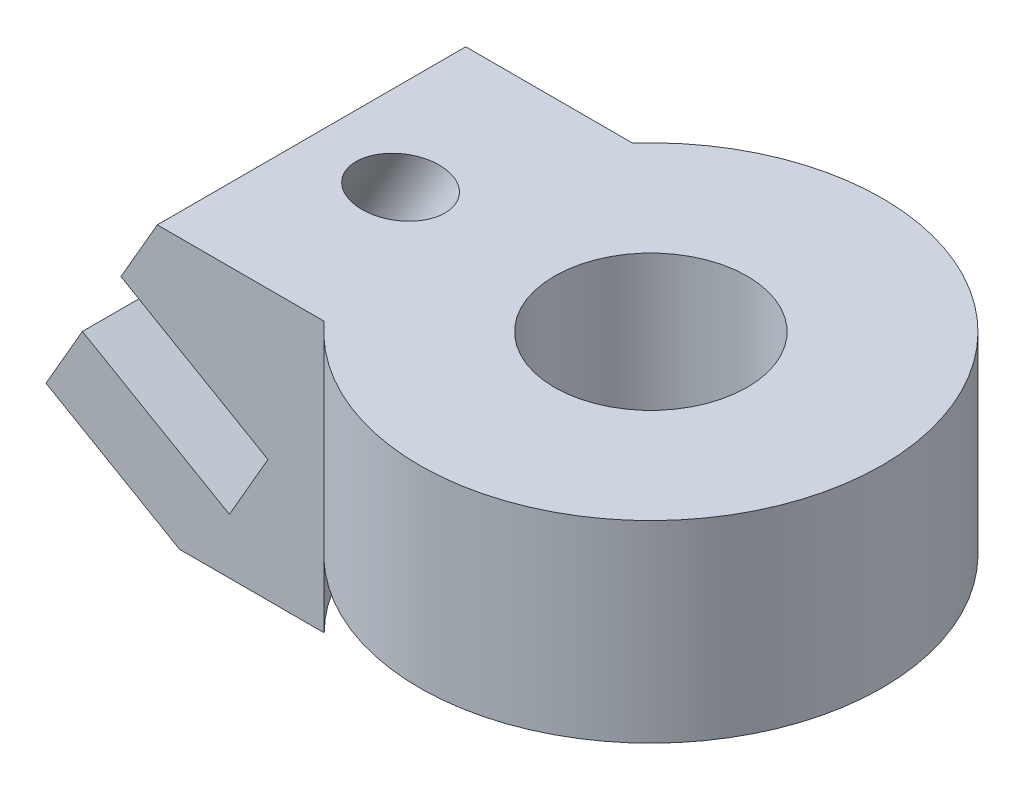
ISO-10303-21;
HEADER;
FILE_DESCRIPTION(('STEP AP214'),'2;1');
FILE_NAME('part.step','',(''),(''),'','','');
FILE_SCHEMA(('AUTOMOTIVE_DESIGN { 1 0 10303 214 1 1 1 1 }'));
ENDSEC;
DATA;
#1=APPLICATION_CONTEXT('core data for automotive mechanical design processes');
#2=APPLICATION_PROTOCOL_DEFINITION('international standard','automotive_design',2000,#1);
#3=PRODUCT_CONTEXT('',#1,'mechanical');
#4=PRODUCT('Part','Part','',(#3));
#5=PRODUCT_RELATED_PRODUCT_CATEGORY('part','',(#4));
#6=PRODUCT_DEFINITION_FORMATION('','',#4);
#7=PRODUCT_DEFINITION_CONTEXT('part definition',#1,'design');
#8=PRODUCT_DEFINITION('design','',#6,#7);
#9=PRODUCT_DEFINITION_SHAPE('','',#8);
#10=(LENGTH_UNIT() NAMED_UNIT(*) SI_UNIT(.MILLI.,.METRE.));
#11=(NAMED_UNIT(*) PLANE_ANGLE_UNIT() SI_UNIT($,.RADIAN.));
#12=(NAMED_UNIT(*) SI_UNIT($,.STERADIAN.) SOLID_ANGLE_UNIT());
#13=UNCERTAINTY_MEASURE_WITH_UNIT(LENGTH_MEASURE(1.E-05),#10,'distance_accuracy_value','');
#14=(GEOMETRIC_REPRESENTATION_CONTEXT(3) GLOBAL_UNCERTAINTY_ASSIGNED_CONTEXT((#13)) GLOBAL_UNIT_ASSIGNED_CONTEXT((#10,
#11,#12)) REPRESENTATION_CONTEXT('',''));
#15=CARTESIAN_POINT('',(0.,0.,0.));
#16=DIRECTION('',(0.,0.,1.));
#17=DIRECTION('',(1.,0.,0.));
#18=AXIS2_PLACEMENT_3D('',#15,#16,#17);
#19=CARTESIAN_POINT('',(0.,0.,-4.));
#20=DIRECTION('',(0.,0.,1.));
#21=DIRECTION('',(1.,0.,0.));
#22=AXIS2_PLACEMENT_3D('',#19,#20,#21);
#23=PLANE('',#22);
#24=DIRECTION('',(-0.86602540378444,0.499999999999998,0.));
#25=VECTOR('',#24,1.);
#26=CARTESIAN_POINT('',(-10.8212796130507,-0.499999999999994,-4.));
#27=LINE('',#26,#25);
#28=CARTESIAN_POINT('',(-8.22320340169734,-2.,-4.));
#29=VERTEX_POINT('',#28);
#30=CARTESIAN_POINT('',(-11.6873050168351,0.,-4.));
#31=VERTEX_POINT('',#30);
#32=EDGE_CURVE('E47',#29,#31,#27,.T.);
#33=ORIENTED_EDGE('',*,*,#32,.T.);
#34=DIRECTION('',(-0.499999999999998,-0.86602540378444,0.));
#35=VECTOR('',#34,1.);
#36=CARTESIAN_POINT('',(-8.76547876262637,5.06075152317826,-4.));
#37=LINE('',#36,#35);
#38=CARTESIAN_POINT('',(-10.7439293438611,1.63397459621556,-4.));
#39=VERTEX_POINT('',#38);
#40=EDGE_CURVE('E122',#39,#31,#37,.T.);
#41=ORIENTED_EDGE('',*,*,#40,.F.);
#42=DIRECTION('',(-0.86602540378444,0.499999999999998,0.));
#43=VECTOR('',#42,1.);
#44=CARTESIAN_POINT('',(-10.7439293438611,1.63397459621556,-4.));
#45=LINE('',#44,#43);
#46=CARTESIAN_POINT('',(-6.93048280810391,-0.567719787744073,-4.));
#47=VERTEX_POINT('',#46);
#48=EDGE_CURVE('E55',#47,#39,#45,.T.);
#49=ORIENTED_EDGE('',*,*,#48,.F.);
#50=DIRECTION('',(-0.499999999999998,-0.86602540378444,0.));
#51=VECTOR('',#50,1.);
#52=CARTESIAN_POINT('',(-5.93048280810391,1.16433101982481,-4.));
#53=LINE('',#52,#51);
#54=CARTESIAN_POINT('',(-5.93048280810391,1.16433101982481,-4.));
#55=VERTEX_POINT('',#54);
#56=EDGE_CURVE('E185',#55,#47,#53,.T.);
#57=ORIENTED_EDGE('',*,*,#56,.F.);
#58=DIRECTION('',(-0.86602540378444,0.499999999999998,0.));
#59=VECTOR('',#58,1.);
#60=CARTESIAN_POINT('',(-9.74392934386107,3.36602540378444,-4.));
#61=LINE('',#60,#59);
#62=CARTESIAN_POINT('',(-9.74392934386107,3.36602540378444,-4.));
#63=VERTEX_POINT('',#62);
#64=EDGE_CURVE('E187',#55,#63,#61,.T.);
#65=ORIENTED_EDGE('',*,*,#64,.T.);
#66=CARTESIAN_POINT('',(-8.80055367088702,5.,-4.));
#67=VERTEX_POINT('',#66);
#68=EDGE_CURVE('E128',#67,#63,#37,.T.);
#69=ORIENTED_EDGE('',*,*,#68,.F.);
#70=DIRECTION('',(-1.,0.,0.));
#71=VECTOR('',#70,1.);
#72=CARTESIAN_POINT('',(-3.07009589621998,5.,-4.));
#73=LINE('',#72,#71);
#74=CARTESIAN_POINT('',(-4.47213595499958,5.,-4.));
#75=VERTEX_POINT('',#74);
#76=EDGE_CURVE('E117',#75,#67,#73,.T.);
#77=ORIENTED_EDGE('',*,*,#76,.F.);
#78=DIRECTION('',(0.,-1.,0.));
#79=VECTOR('',#78,1.);
#80=CARTESIAN_POINT('',(-4.47213595499958,5.,-4.));
#81=LINE('',#80,#79);
#82=CARTESIAN_POINT('',(-4.47213595499958,0.,-4.));
#83=VERTEX_POINT('',#82);
#84=EDGE_CURVE('E147',#75,#83,#81,.T.);
#85=ORIENTED_EDGE('',*,*,#84,.T.);
#86=DIRECTION('',(0.,1.,0.));
#87=VECTOR('',#86,1.);
#88=CARTESIAN_POINT('',(-4.47213595499958,-2.,-4.));
#89=LINE('',#88,#87);
#90=CARTESIAN_POINT('',(-4.47213595499958,-2.,-4.));
#91=VERTEX_POINT('',#90);
#92=EDGE_CURVE('E167',#91,#83,#89,.T.);
#93=ORIENTED_EDGE('',*,*,#92,.F.);
#94=DIRECTION('',(1.,0.,0.));
#95=VECTOR('',#94,1.);
#96=CARTESIAN_POINT('',(-11.6873050168351,-2.,-4.));
#97=LINE('',#96,#95);
#98=EDGE_CURVE('E124',#29,#91,#97,.T.);
#99=ORIENTED_EDGE('',*,*,#98,.F.);
#100=EDGE_LOOP('',(#33,#41,#49,#57,#65,#69,#77,#85,#93,#99));
#101=FACE_BOUND('',#100,.T.);
#102=ADVANCED_FACE('F33',(#101),#23,.F.);
#103=CARTESIAN_POINT('',(0.,0.,4.));
#104=DIRECTION('',(0.,0.,1.));
#105=DIRECTION('',(1.,0.,0.));
#106=AXIS2_PLACEMENT_3D('',#103,#104,#105);
#107=PLANE('',#106);
#108=DIRECTION('',(-0.499999999999998,-0.86602540378444,0.));
#109=VECTOR('',#108,1.);
#110=CARTESIAN_POINT('',(-8.76547876262637,5.06075152317826,4.));
#111=LINE('',#110,#109);
#112=CARTESIAN_POINT('',(-10.7439293438611,1.63397459621556,4.));
#113=VERTEX_POINT('',#112);
#114=CARTESIAN_POINT('',(-11.6873050168351,0.,4.));
#115=VERTEX_POINT('',#114);
#116=EDGE_CURVE('E134',#113,#115,#111,.T.);
#117=ORIENTED_EDGE('',*,*,#116,.T.);
#118=DIRECTION('',(0.86602540378444,-0.499999999999998,0.));
#119=VECTOR('',#118,1.);
#120=CARTESIAN_POINT('',(-7.7160926366488,-2.29278053670974,4.));
#121=LINE('',#120,#119);
#122=CARTESIAN_POINT('',(-8.22320340169734,-2.,4.));
#123=VERTEX_POINT('',#122);
#124=EDGE_CURVE('E111',#115,#123,#121,.T.);
#125=ORIENTED_EDGE('',*,*,#124,.T.);
#126=DIRECTION('',(-1.,0.,0.));
#127=VECTOR('',#126,1.);
#128=CARTESIAN_POINT('',(-11.6873050168351,-2.,4.));
#129=LINE('',#128,#127);
#130=CARTESIAN_POINT('',(-4.47213595499958,-2.,4.));
#131=VERTEX_POINT('',#130);
#132=EDGE_CURVE('E174',#131,#123,#129,.T.);
#133=ORIENTED_EDGE('',*,*,#132,.F.);
#134=DIRECTION('',(0.,1.,0.));
#135=VECTOR('',#134,1.);
#136=CARTESIAN_POINT('',(-4.47213595499958,-2.,4.));
#137=LINE('',#136,#135);
#138=CARTESIAN_POINT('',(-4.47213595499958,0.,4.));
#139=VERTEX_POINT('',#138);
#140=EDGE_CURVE('E173',#131,#139,#137,.T.);
#141=ORIENTED_EDGE('',*,*,#140,.T.);
#142=DIRECTION('',(0.,-1.,0.));
#143=VECTOR('',#142,1.);
#144=CARTESIAN_POINT('',(-4.47213595499958,5.,4.));
#145=LINE('',#144,#143);
#146=CARTESIAN_POINT('',(-4.47213595499958,5.,4.));
#147=VERTEX_POINT('',#146);
#148=EDGE_CURVE('E116',#147,#139,#145,.T.);
#149=ORIENTED_EDGE('',*,*,#148,.F.);
#150=DIRECTION('',(-1.,0.,0.));
#151=VECTOR('',#150,1.);
#152=CARTESIAN_POINT('',(-3.07009589621998,5.,4.));
#153=LINE('',#152,#151);
#154=CARTESIAN_POINT('',(-8.80055367088702,5.,4.));
#155=VERTEX_POINT('',#154);
#156=EDGE_CURVE('E140',#147,#155,#153,.T.);
#157=ORIENTED_EDGE('',*,*,#156,.T.);
#158=CARTESIAN_POINT('',(-9.74392934386107,3.36602540378444,4.));
#159=VERTEX_POINT('',#158);
#160=EDGE_CURVE('E129',#155,#159,#111,.T.);
#161=ORIENTED_EDGE('',*,*,#160,.T.);
#162=DIRECTION('',(0.86602540378444,-0.499999999999998,0.));
#163=VECTOR('',#162,1.);
#164=CARTESIAN_POINT('',(-9.74392934386107,3.36602540378444,4.));
#165=LINE('',#164,#163);
#166=CARTESIAN_POINT('',(-5.93048280810391,1.16433101982481,4.));
#167=VERTEX_POINT('',#166);
#168=EDGE_CURVE('E192',#159,#167,#165,.T.);
#169=ORIENTED_EDGE('',*,*,#168,.T.);
#170=DIRECTION('',(-0.499999999999998,-0.86602540378444,0.));
#171=VECTOR('',#170,1.);
#172=CARTESIAN_POINT('',(-5.93048280810391,1.16433101982481,4.));
#173=LINE('',#172,#171);
#174=CARTESIAN_POINT('',(-6.93048280810391,-0.567719787744074,4.));
#175=VERTEX_POINT('',#174);
#176=EDGE_CURVE('E178',#167,#175,#173,.T.);
#177=ORIENTED_EDGE('',*,*,#176,.T.);
#178=DIRECTION('',(0.86602540378444,-0.499999999999998,0.));
#179=VECTOR('',#178,1.);
#180=CARTESIAN_POINT('',(-10.7439293438611,1.63397459621556,4.));
#181=LINE('',#180,#179);
#182=EDGE_CURVE('E201',#113,#175,#181,.T.);
#183=ORIENTED_EDGE('',*,*,#182,.F.);
#184=EDGE_LOOP('',(#117,#125,#133,#141,#149,#157,#161,#169,#177,#183));
#185=FACE_BOUND('',#184,.T.);
#186=ADVANCED_FACE('F235',(#185),#107,.T.);
#187=CARTESIAN_POINT('',(-0.47213595499956,-2.,0.));
#188=DIRECTION('',(0.,1.,0.));
#189=DIRECTION('',(0.,0.,1.));
#190=AXIS2_PLACEMENT_3D('',#187,#188,#189);
#191=PLANE('',#190);
#192=DIRECTION('',(0.,0.,1.));
#193=VECTOR('',#192,1.);
#194=CARTESIAN_POINT('',(-8.22320340169734,-2.,0.));
#195=LINE('',#194,#193);
#196=EDGE_CURVE('E11',#29,#123,#195,.T.);
#197=ORIENTED_EDGE('',*,*,#196,.F.);
#198=ORIENTED_EDGE('',*,*,#98,.T.);
#199=CARTESIAN_POINT('',(-0.47213595499956,-2.,0.));
#200=DIRECTION('',(0.,1.,0.));
#201=DIRECTION('',(0.,0.,1.));
#202=AXIS2_PLACEMENT_3D('',#199,#200,#201);
#203=CIRCLE('',#202,5.6568542494924);
#204=EDGE_CURVE('E172',#91,#131,#203,.T.);
#205=ORIENTED_EDGE('',*,*,#204,.T.);
#206=ORIENTED_EDGE('',*,*,#132,.T.);
#207=EDGE_LOOP('',(#197,#198,#205,#206));
#208=FACE_BOUND('',#207,.T.);
#209=ADVANCED_FACE('F240',(#208),#191,.F.);
#210=CARTESIAN_POINT('',(-8.76547876262637,5.06075152317826,0.));
#211=DIRECTION('',(-0.86602540378444,0.499999999999998,0.));
#212=DIRECTION('',(-0.499999999999998,-0.86602540378444,0.));
#213=AXIS2_PLACEMENT_3D('',#210,#211,#212);
#214=PLANE('',#213);
#215=ORIENTED_EDGE('',*,*,#116,.F.);
#216=DIRECTION('',(0.,0.,1.));
#217=VECTOR('',#216,1.);
#218=CARTESIAN_POINT('',(-10.7439293438611,1.63397459621556,-4.));
#219=LINE('',#218,#217);
#220=EDGE_CURVE('E125',#39,#113,#219,.T.);
#221=ORIENTED_EDGE('',*,*,#220,.F.);
#222=ORIENTED_EDGE('',*,*,#40,.T.);
#223=DIRECTION('',(0.,0.,1.));
#224=VECTOR('',#223,1.);
#225=CARTESIAN_POINT('',(-11.6873050168351,0.,-4.));
#226=LINE('',#225,#224);
#227=EDGE_CURVE('E108',#31,#115,#226,.T.);
#228=ORIENTED_EDGE('',*,*,#227,.T.);
#229=EDGE_LOOP('',(#215,#221,#222,#228));
#230=FACE_BOUND('',#229,.T.);
#231=ADVANCED_FACE('F127',(#230),#214,.T.);
#232=CARTESIAN_POINT('',(0.,0.,0.));
#233=DIRECTION('',(0.,1.,0.));
#234=DIRECTION('',(0.,0.,1.));
#235=AXIS2_PLACEMENT_3D('',#232,#233,#234);
#236=PLANE('',#235);
#237=CARTESIAN_POINT('',(0.,0.,0.));
#238=DIRECTION('',(0.,1.,0.));
#239=DIRECTION('',(0.,0.,1.));
#240=AXIS2_PLACEMENT_3D('',#237,#238,#239);
#241=CIRCLE('',#240,2.5);
#242=CARTESIAN_POINT('',(0.,0.,2.5));
#243=VERTEX_POINT('',#242);
#244=EDGE_CURVE('E153',#243,#243,#241,.F.);
#245=ORIENTED_EDGE('',*,*,#244,.F.);
#246=EDGE_LOOP('',(#245));
#247=FACE_BOUND('',#246,.T.);
#248=CARTESIAN_POINT('',(-0.47213595499956,0.,0.));
#249=DIRECTION('',(0.,1.,0.));
#250=DIRECTION('',(0.,0.,1.));
#251=AXIS2_PLACEMENT_3D('',#248,#249,#250);
#252=CIRCLE('',#251,5.6568542494924);
#253=EDGE_CURVE('E170',#83,#139,#252,.T.);
#254=ORIENTED_EDGE('',*,*,#253,.F.);
#255=CARTESIAN_POINT('',(0.,0.,0.));
#256=DIRECTION('',(0.,1.,0.));
#257=DIRECTION('',(0.,0.,1.));
#258=AXIS2_PLACEMENT_3D('',#255,#256,#257);
#259=CIRCLE('',#258,6.);
#260=EDGE_CURVE('E156',#139,#83,#259,.T.);
#261=ORIENTED_EDGE('',*,*,#260,.F.);
#262=EDGE_LOOP('',(#254,#261));
#263=FACE_BOUND('',#262,.T.);
#264=ADVANCED_FACE('F252',(#247,#263),#236,.F.);
#265=CARTESIAN_POINT('',(0.,5.,0.));
#266=DIRECTION('',(0.,1.,0.));
#267=DIRECTION('',(0.,0.,1.));
#268=AXIS2_PLACEMENT_3D('',#265,#266,#267);
#269=PLANE('',#268);
#270=CARTESIAN_POINT('',(-6.4911525941285,5.,0.));
#271=DIRECTION('',(0.,1.,0.));
#272=DIRECTION('',(-1.,0.,0.));
#273=AXIS2_PLACEMENT_3D('',#270,#271,#272);
#274=ELLIPSE('',#273,1.15470053837925,1.);
#275=CARTESIAN_POINT('',(-7.64585313250775,5.,0.));
#276=VERTEX_POINT('',#275);
#277=EDGE_CURVE('E206',#276,#276,#274,.T.);
#278=ORIENTED_EDGE('',*,*,#277,.F.);
#279=EDGE_LOOP('',(#278));
#280=FACE_BOUND('',#279,.T.);
#281=CARTESIAN_POINT('',(0.,5.,0.));
#282=DIRECTION('',(0.,1.,0.));
#283=DIRECTION('',(0.,0.,1.));
#284=AXIS2_PLACEMENT_3D('',#281,#282,#283);
#285=CIRCLE('',#284,2.5);
#286=CARTESIAN_POINT('',(0.,5.,2.5));
#287=VERTEX_POINT('',#286);
#288=EDGE_CURVE('E150',#287,#287,#285,.T.);
#289=ORIENTED_EDGE('',*,*,#288,.F.);
#290=EDGE_LOOP('',(#289));
#291=FACE_BOUND('',#290,.T.);
#292=ORIENTED_EDGE('',*,*,#76,.T.);
#293=DIRECTION('',(0.,0.,1.));
#294=VECTOR('',#293,1.);
#295=CARTESIAN_POINT('',(-8.80055367088702,5.,0.));
#296=LINE('',#295,#294);
#297=EDGE_CURVE('E132',#67,#155,#296,.T.);
#298=ORIENTED_EDGE('',*,*,#297,.T.);
#299=ORIENTED_EDGE('',*,*,#156,.F.);
#300=CARTESIAN_POINT('',(0.,5.,0.));
#301=DIRECTION('',(0.,1.,0.));
#302=DIRECTION('',(0.,0.,1.));
#303=AXIS2_PLACEMENT_3D('',#300,#301,#302);
#304=CIRCLE('',#303,6.);
#305=EDGE_CURVE('E41',#147,#75,#304,.T.);
#306=ORIENTED_EDGE('',*,*,#305,.T.);
#307=EDGE_LOOP('',(#292,#298,#299,#306));
#308=FACE_BOUND('',#307,.T.);
#309=ADVANCED_FACE('F250',(#280,#291,#308),#269,.T.);
#310=CARTESIAN_POINT('',(0.,5.,0.));
#311=DIRECTION('',(0.,-1.,0.));
#312=DIRECTION('',(0.,0.,-1.));
#313=AXIS2_PLACEMENT_3D('',#310,#311,#312);
#314=CYLINDRICAL_SURFACE('',#313,6.);
#315=ORIENTED_EDGE('',*,*,#84,.F.);
#316=ORIENTED_EDGE('',*,*,#305,.F.);
#317=ORIENTED_EDGE('',*,*,#148,.T.);
#318=ORIENTED_EDGE('',*,*,#260,.T.);
#319=EDGE_LOOP('',(#315,#316,#317,#318));
#320=FACE_BOUND('',#319,.T.);
#321=ADVANCED_FACE('F35',(#320),#314,.T.);
#322=CARTESIAN_POINT('',(0.,-7.07106781186548,0.));
#323=DIRECTION('',(0.,1.,0.));
#324=DIRECTION('',(0.,0.,1.));
#325=AXIS2_PLACEMENT_3D('',#322,#323,#324);
#326=CYLINDRICAL_SURFACE('',#325,2.5);
#327=ORIENTED_EDGE('',*,*,#244,.T.);
#328=EDGE_LOOP('',(#327));
#329=FACE_BOUND('',#328,.T.);
#330=ORIENTED_EDGE('',*,*,#288,.T.);
#331=EDGE_LOOP('',(#330));
#332=FACE_BOUND('',#331,.T.);
#333=ADVANCED_FACE('F245',(#329,#332),#326,.F.);
#334=DIRECTION('',(0.,0.,1.));
#335=VECTOR('',#334,1.);
#336=CARTESIAN_POINT('',(-9.74392934386107,3.36602540378444,-4.));
#337=LINE('',#336,#335);
#338=EDGE_CURVE('E195',#63,#159,#337,.T.);
#339=ORIENTED_EDGE('',*,*,#338,.T.);
#340=ORIENTED_EDGE('',*,*,#160,.F.);
#341=ORIENTED_EDGE('',*,*,#297,.F.);
#342=ORIENTED_EDGE('',*,*,#68,.T.);
#343=EDGE_LOOP('',(#339,#340,#341,#342));
#344=FACE_BOUND('',#343,.T.);
#345=ADVANCED_FACE('F248',(#344),#214,.T.);
#346=CARTESIAN_POINT('',(-0.47213595499956,-2.,0.));
#347=DIRECTION('',(0.,1.,0.));
#348=DIRECTION('',(0.,0.,1.));
#349=AXIS2_PLACEMENT_3D('',#346,#347,#348);
#350=CYLINDRICAL_SURFACE('',#349,5.6568542494924);
#351=ORIENTED_EDGE('',*,*,#253,.T.);
#352=ORIENTED_EDGE('',*,*,#140,.F.);
#353=ORIENTED_EDGE('',*,*,#204,.F.);
#354=ORIENTED_EDGE('',*,*,#92,.T.);
#355=EDGE_LOOP('',(#351,#352,#353,#354));
#356=FACE_BOUND('',#355,.T.);
#357=ADVANCED_FACE('F168',(#356),#350,.F.);
#358=CARTESIAN_POINT('',(-5.93048280810391,1.16433101982481,-4.));
#359=DIRECTION('',(-0.86602540378444,0.499999999999998,0.));
#360=DIRECTION('',(-0.499999999999998,-0.86602540378444,0.));
#361=AXIS2_PLACEMENT_3D('',#358,#359,#360);
#362=PLANE('',#361);
#363=ORIENTED_EDGE('',*,*,#176,.F.);
#364=DIRECTION('',(0.,0.,-1.));
#365=VECTOR('',#364,1.);
#366=CARTESIAN_POINT('',(-5.93048280810391,1.16433101982481,-4.));
#367=LINE('',#366,#365);
#368=EDGE_CURVE('E190',#167,#55,#367,.T.);
#369=ORIENTED_EDGE('',*,*,#368,.T.);
#370=ORIENTED_EDGE('',*,*,#56,.T.);
#371=DIRECTION('',(0.,0.,-1.));
#372=VECTOR('',#371,1.);
#373=CARTESIAN_POINT('',(-6.93048280810391,-0.567719787744073,-4.));
#374=LINE('',#373,#372);
#375=EDGE_CURVE('E199',#175,#47,#374,.T.);
#376=ORIENTED_EDGE('',*,*,#375,.F.);
#377=EDGE_LOOP('',(#363,#369,#370,#376));
#378=FACE_BOUND('',#377,.T.);
#379=ADVANCED_FACE('F271',(#378),#362,.T.);
#380=CARTESIAN_POINT('',(-0.978450581234705,-1.69472611939382,0.));
#381=DIRECTION('',(0.499999999999998,0.86602540378444,0.));
#382=DIRECTION('',(-0.86602540378444,0.499999999999998,0.));
#383=AXIS2_PLACEMENT_3D('',#380,#381,#382);
#384=PLANE('',#383);
#385=CARTESIAN_POINT('',(-8.01187853629218,2.36602540378443,0.));
#386=DIRECTION('',(0.499999999999998,0.86602540378444,0.));
#387=DIRECTION('',(-0.86602540378444,0.499999999999998,0.));
#388=AXIS2_PLACEMENT_3D('',#385,#386,#387);
#389=CIRCLE('',#388,1.);
#390=CARTESIAN_POINT('',(-8.87790394007662,2.86602540378443,0.));
#391=VERTEX_POINT('',#390);
#392=EDGE_CURVE('E209',#391,#391,#389,.T.);
#393=ORIENTED_EDGE('',*,*,#392,.T.);
#394=EDGE_LOOP('',(#393));
#395=FACE_BOUND('',#394,.T.);
#396=ORIENTED_EDGE('',*,*,#338,.F.);
#397=ORIENTED_EDGE('',*,*,#64,.F.);
#398=ORIENTED_EDGE('',*,*,#368,.F.);
#399=ORIENTED_EDGE('',*,*,#168,.F.);
#400=EDGE_LOOP('',(#396,#397,#398,#399));
#401=FACE_BOUND('',#400,.T.);
#402=ADVANCED_FACE('F231',(#395,#401),#384,.F.);
#403=CARTESIAN_POINT('',(-1.9784505812347,-3.4267769269627,0.));
#404=DIRECTION('',(0.499999999999998,0.86602540378444,0.));
#405=DIRECTION('',(-0.86602540378444,0.499999999999998,0.));
#406=AXIS2_PLACEMENT_3D('',#403,#404,#405);
#407=PLANE('',#406);
#408=CARTESIAN_POINT('',(-9.01187853629218,0.633974596215556,0.));
#409=DIRECTION('',(0.499999999999998,0.86602540378444,0.));
#410=DIRECTION('',(-0.86602540378444,0.499999999999998,0.));
#411=AXIS2_PLACEMENT_3D('',#408,#409,#410);
#412=CIRCLE('',#411,1.);
#413=CARTESIAN_POINT('',(-9.87790394007662,1.13397459621555,0.));
#414=VERTEX_POINT('',#413);
#415=EDGE_CURVE('E212',#414,#414,#412,.T.);
#416=ORIENTED_EDGE('',*,*,#415,.F.);
#417=EDGE_LOOP('',(#416));
#418=FACE_BOUND('',#417,.T.);
#419=ORIENTED_EDGE('',*,*,#220,.T.);
#420=ORIENTED_EDGE('',*,*,#182,.T.);
#421=ORIENTED_EDGE('',*,*,#375,.T.);
#422=ORIENTED_EDGE('',*,*,#48,.T.);
#423=EDGE_LOOP('',(#419,#420,#421,#422));
#424=FACE_BOUND('',#423,.T.);
#425=ADVANCED_FACE('F222',(#418,#424),#407,.T.);
#426=CARTESIAN_POINT('',(-2.92182625420876,-5.06075152317825,0.));
#427=DIRECTION('',(-0.499999999999998,-0.86602540378444,0.));
#428=DIRECTION('',(0.86602540378444,-0.499999999999998,0.));
#429=AXIS2_PLACEMENT_3D('',#426,#427,#428);
#430=PLANE('',#429);
#431=CARTESIAN_POINT('',(-9.95525420926623,-1.,0.));
#432=DIRECTION('',(-0.499999999999998,-0.86602540378444,0.));
#433=DIRECTION('',(0.86602540378444,-0.499999999999998,0.));
#434=AXIS2_PLACEMENT_3D('',#431,#432,#433);
#435=CIRCLE('',#434,1.);
#436=CARTESIAN_POINT('',(-9.0892288054818,-1.5,0.));
#437=VERTEX_POINT('',#436);
#438=EDGE_CURVE('E215',#437,#437,#435,.T.);
#439=ORIENTED_EDGE('',*,*,#438,.F.);
#440=EDGE_LOOP('',(#439));
#441=FACE_BOUND('',#440,.T.);
#442=ORIENTED_EDGE('',*,*,#196,.T.);
#443=ORIENTED_EDGE('',*,*,#124,.F.);
#444=ORIENTED_EDGE('',*,*,#227,.F.);
#445=ORIENTED_EDGE('',*,*,#32,.F.);
#446=EDGE_LOOP('',(#442,#443,#444,#445));
#447=FACE_BOUND('',#446,.T.);
#448=ADVANCED_FACE('F109',(#441,#447),#430,.T.);
#449=CARTESIAN_POINT('',(-5.95525420926625,5.92820323027552,0.));
#450=DIRECTION('',(-0.499999999999998,-0.86602540378444,0.));
#451=DIRECTION('',(0.86602540378444,-0.499999999999998,0.));
#452=AXIS2_PLACEMENT_3D('',#449,#450,#451);
#453=CYLINDRICAL_SURFACE('',#452,1.);
#454=ORIENTED_EDGE('',*,*,#415,.T.);
#455=EDGE_LOOP('',(#454));
#456=FACE_BOUND('',#455,.T.);
#457=ORIENTED_EDGE('',*,*,#438,.T.);
#458=EDGE_LOOP('',(#457));
#459=FACE_BOUND('',#458,.T.);
#460=ADVANCED_FACE('F219',(#456,#459),#453,.F.);
#461=ORIENTED_EDGE('',*,*,#277,.T.);
#462=EDGE_LOOP('',(#461));
#463=FACE_BOUND('',#462,.T.);
#464=ORIENTED_EDGE('',*,*,#392,.F.);
#465=EDGE_LOOP('',(#464));
#466=FACE_BOUND('',#465,.T.);
#467=ADVANCED_FACE('F228',(#463,#466),#453,.F.);
#468=CLOSED_SHELL('',(#102,#186,#209,#231,#264,#309,#321,#333,#345,#357,#379,#402,#425,#448,
#460,#467));
#469=MANIFOLD_SOLID_BREP('B2',#468);
#470=ADVANCED_BREP_SHAPE_REPRESENTATION('',(#18,#469),#14);
#471=SHAPE_DEFINITION_REPRESENTATION(#9,#470);
ENDSEC;
END-ISO-10303-21;
